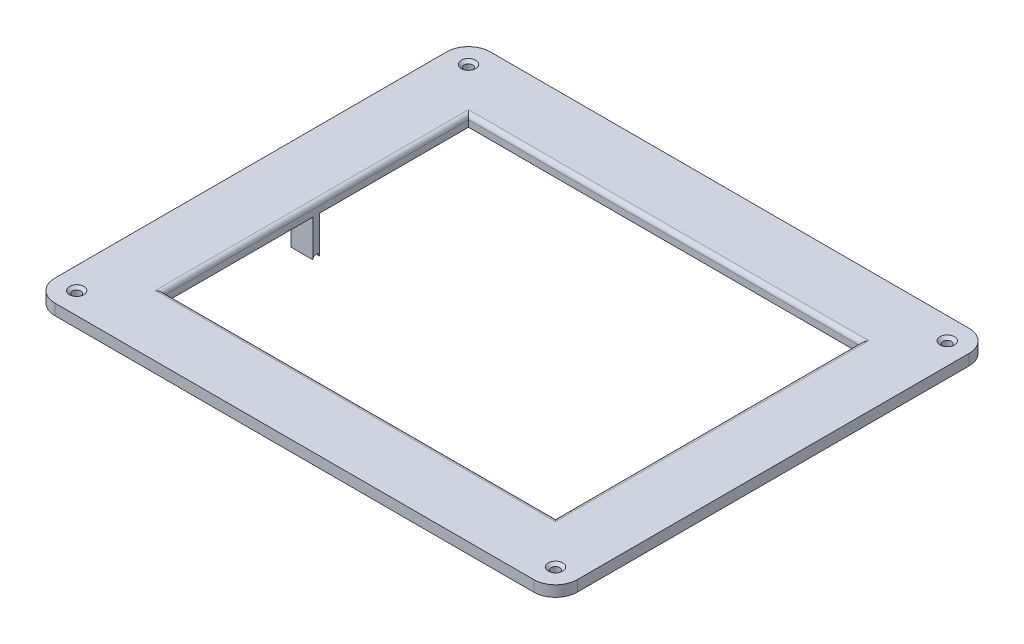
ISO-10303-21;
HEADER;
FILE_DESCRIPTION(('STEP AP214'),'2;1');
FILE_NAME('part.step','',(''),(''),'','','');
FILE_SCHEMA(('AUTOMOTIVE_DESIGN { 1 0 10303 214 1 1 1 1 }'));
ENDSEC;
DATA;
#1=APPLICATION_CONTEXT('core data for automotive mechanical design processes');
#2=APPLICATION_PROTOCOL_DEFINITION('international standard','automotive_design',2000,#1);
#3=PRODUCT_CONTEXT('',#1,'mechanical');
#4=PRODUCT('Part','Part','',(#3));
#5=PRODUCT_RELATED_PRODUCT_CATEGORY('part','',(#4));
#6=PRODUCT_DEFINITION_FORMATION('','',#4);
#7=PRODUCT_DEFINITION_CONTEXT('part definition',#1,'design');
#8=PRODUCT_DEFINITION('design','',#6,#7);
#9=PRODUCT_DEFINITION_SHAPE('','',#8);
#10=(LENGTH_UNIT() NAMED_UNIT(*) SI_UNIT(.MILLI.,.METRE.));
#11=(NAMED_UNIT(*) PLANE_ANGLE_UNIT() SI_UNIT($,.RADIAN.));
#12=(NAMED_UNIT(*) SI_UNIT($,.STERADIAN.) SOLID_ANGLE_UNIT());
#13=UNCERTAINTY_MEASURE_WITH_UNIT(LENGTH_MEASURE(1.E-05),#10,'distance_accuracy_value','');
#14=(GEOMETRIC_REPRESENTATION_CONTEXT(3) GLOBAL_UNCERTAINTY_ASSIGNED_CONTEXT((#13)) GLOBAL_UNIT_ASSIGNED_CONTEXT((#10,
#11,#12)) REPRESENTATION_CONTEXT('',''));
#15=CARTESIAN_POINT('',(0.,0.,0.));
#16=DIRECTION('',(0.,0.,1.));
#17=DIRECTION('',(1.,0.,0.));
#18=AXIS2_PLACEMENT_3D('',#15,#16,#17);
#19=CARTESIAN_POINT('',(152.4,6.35,127.));
#20=DIRECTION('',(-1.,0.,0.));
#21=DIRECTION('',(0.,0.,1.));
#22=AXIS2_PLACEMENT_3D('',#19,#20,#21);
#23=PLANE('',#22);
#24=DIRECTION('',(0.,0.,-1.));
#25=VECTOR('',#24,1.);
#26=CARTESIAN_POINT('',(152.4,0.,127.));
#27=LINE('',#26,#25);
#28=CARTESIAN_POINT('',(152.4,0.,114.3));
#29=VERTEX_POINT('',#28);
#30=CARTESIAN_POINT('',(152.4,0.,-114.3));
#31=VERTEX_POINT('',#30);
#32=EDGE_CURVE('E301',#29,#31,#27,.T.);
#33=ORIENTED_EDGE('',*,*,#32,.T.);
#34=DIRECTION('',(0.,-1.,0.));
#35=VECTOR('',#34,1.);
#36=CARTESIAN_POINT('',(152.4,6.35,-114.3));
#37=LINE('',#36,#35);
#38=CARTESIAN_POINT('',(152.4,6.35,-114.3));
#39=VERTEX_POINT('',#38);
#40=EDGE_CURVE('E406',#31,#39,#37,.F.);
#41=ORIENTED_EDGE('',*,*,#40,.T.);
#42=DIRECTION('',(0.,0.,-1.));
#43=VECTOR('',#42,1.);
#44=CARTESIAN_POINT('',(152.4,6.35,127.));
#45=LINE('',#44,#43);
#46=CARTESIAN_POINT('',(152.4,6.35,114.3));
#47=VERTEX_POINT('',#46);
#48=EDGE_CURVE('E313',#47,#39,#45,.T.);
#49=ORIENTED_EDGE('',*,*,#48,.F.);
#50=DIRECTION('',(0.,-1.,0.));
#51=VECTOR('',#50,1.);
#52=CARTESIAN_POINT('',(152.4,6.35,114.3));
#53=LINE('',#52,#51);
#54=EDGE_CURVE('E402',#47,#29,#53,.T.);
#55=ORIENTED_EDGE('',*,*,#54,.T.);
#56=EDGE_LOOP('',(#33,#41,#49,#55));
#57=FACE_BOUND('',#56,.T.);
#58=ADVANCED_FACE('F42',(#57),#23,.F.);
#59=CARTESIAN_POINT('',(-152.4,6.35,-127.));
#60=DIRECTION('',(0.,0.,1.));
#61=DIRECTION('',(1.,0.,0.));
#62=AXIS2_PLACEMENT_3D('',#59,#60,#61);
#63=PLANE('',#62);
#64=DIRECTION('',(-1.,0.,0.));
#65=VECTOR('',#64,1.);
#66=CARTESIAN_POINT('',(-152.4,6.35,-127.));
#67=LINE('',#66,#65);
#68=CARTESIAN_POINT('',(139.7,6.35,-127.));
#69=VERTEX_POINT('',#68);
#70=CARTESIAN_POINT('',(-139.7,6.35,-127.));
#71=VERTEX_POINT('',#70);
#72=EDGE_CURVE('E317',#69,#71,#67,.T.);
#73=ORIENTED_EDGE('',*,*,#72,.F.);
#74=DIRECTION('',(0.,-1.,0.));
#75=VECTOR('',#74,1.);
#76=CARTESIAN_POINT('',(139.7,6.35,-127.));
#77=LINE('',#76,#75);
#78=CARTESIAN_POINT('',(139.7,0.,-127.));
#79=VERTEX_POINT('',#78);
#80=EDGE_CURVE('E386',#69,#79,#77,.T.);
#81=ORIENTED_EDGE('',*,*,#80,.T.);
#82=DIRECTION('',(-1.,0.,0.));
#83=VECTOR('',#82,1.);
#84=CARTESIAN_POINT('',(-152.4,0.,-127.));
#85=LINE('',#84,#83);
#86=CARTESIAN_POINT('',(-139.7,0.,-127.));
#87=VERTEX_POINT('',#86);
#88=EDGE_CURVE('E334',#79,#87,#85,.T.);
#89=ORIENTED_EDGE('',*,*,#88,.T.);
#90=DIRECTION('',(0.,-1.,0.));
#91=VECTOR('',#90,1.);
#92=CARTESIAN_POINT('',(-139.7,6.35,-127.));
#93=LINE('',#92,#91);
#94=EDGE_CURVE('E370',#87,#71,#93,.F.);
#95=ORIENTED_EDGE('',*,*,#94,.T.);
#96=EDGE_LOOP('',(#73,#81,#89,#95));
#97=FACE_BOUND('',#96,.T.);
#98=ADVANCED_FACE('F598',(#97),#63,.F.);
#99=CARTESIAN_POINT('',(-152.4,6.35,127.));
#100=DIRECTION('',(1.,0.,0.));
#101=DIRECTION('',(0.,0.,-1.));
#102=AXIS2_PLACEMENT_3D('',#99,#100,#101);
#103=PLANE('',#102);
#104=DIRECTION('',(0.,0.,1.));
#105=VECTOR('',#104,1.);
#106=CARTESIAN_POINT('',(-152.4,6.35,127.));
#107=LINE('',#106,#105);
#108=CARTESIAN_POINT('',(-152.4,6.35,-114.3));
#109=VERTEX_POINT('',#108);
#110=CARTESIAN_POINT('',(-152.4,6.35,114.3));
#111=VERTEX_POINT('',#110);
#112=EDGE_CURVE('E322',#109,#111,#107,.T.);
#113=ORIENTED_EDGE('',*,*,#112,.F.);
#114=DIRECTION('',(0.,-1.,0.));
#115=VECTOR('',#114,1.);
#116=CARTESIAN_POINT('',(-152.4,6.35,-114.3));
#117=LINE('',#116,#115);
#118=CARTESIAN_POINT('',(-152.4,0.,-114.3));
#119=VERTEX_POINT('',#118);
#120=EDGE_CURVE('E424',#109,#119,#117,.T.);
#121=ORIENTED_EDGE('',*,*,#120,.T.);
#122=DIRECTION('',(0.,0.,1.));
#123=VECTOR('',#122,1.);
#124=CARTESIAN_POINT('',(-152.4,0.,127.));
#125=LINE('',#124,#123);
#126=CARTESIAN_POINT('',(-152.4,0.,114.3));
#127=VERTEX_POINT('',#126);
#128=EDGE_CURVE('E338',#119,#127,#125,.T.);
#129=ORIENTED_EDGE('',*,*,#128,.T.);
#130=DIRECTION('',(0.,-1.,0.));
#131=VECTOR('',#130,1.);
#132=CARTESIAN_POINT('',(-152.4,6.35,114.3));
#133=LINE('',#132,#131);
#134=EDGE_CURVE('E421',#127,#111,#133,.F.);
#135=ORIENTED_EDGE('',*,*,#134,.T.);
#136=EDGE_LOOP('',(#113,#121,#129,#135));
#137=FACE_BOUND('',#136,.T.);
#138=ADVANCED_FACE('F604',(#137),#103,.F.);
#139=CARTESIAN_POINT('',(-152.4,6.35,127.));
#140=DIRECTION('',(0.,0.,-1.));
#141=DIRECTION('',(-1.,0.,0.));
#142=AXIS2_PLACEMENT_3D('',#139,#140,#141);
#143=PLANE('',#142);
#144=DIRECTION('',(1.,0.,0.));
#145=VECTOR('',#144,1.);
#146=CARTESIAN_POINT('',(-152.4,6.35,127.));
#147=LINE('',#146,#145);
#148=CARTESIAN_POINT('',(-139.7,6.35,127.));
#149=VERTEX_POINT('',#148);
#150=CARTESIAN_POINT('',(139.7,6.35,127.));
#151=VERTEX_POINT('',#150);
#152=EDGE_CURVE('E326',#149,#151,#147,.T.);
#153=ORIENTED_EDGE('',*,*,#152,.F.);
#154=DIRECTION('',(0.,-1.,0.));
#155=VECTOR('',#154,1.);
#156=CARTESIAN_POINT('',(-139.7,6.35,127.));
#157=LINE('',#156,#155);
#158=CARTESIAN_POINT('',(-139.7,0.,127.));
#159=VERTEX_POINT('',#158);
#160=EDGE_CURVE('E11',#149,#159,#157,.T.);
#161=ORIENTED_EDGE('',*,*,#160,.T.);
#162=DIRECTION('',(1.,0.,0.));
#163=VECTOR('',#162,1.);
#164=CARTESIAN_POINT('',(-152.4,0.,127.));
#165=LINE('',#164,#163);
#166=CARTESIAN_POINT('',(139.7,0.,127.));
#167=VERTEX_POINT('',#166);
#168=EDGE_CURVE('E318',#159,#167,#165,.T.);
#169=ORIENTED_EDGE('',*,*,#168,.T.);
#170=DIRECTION('',(0.,-1.,0.));
#171=VECTOR('',#170,1.);
#172=CARTESIAN_POINT('',(139.7,6.35,127.));
#173=LINE('',#172,#171);
#174=EDGE_CURVE('E52',#167,#151,#173,.F.);
#175=ORIENTED_EDGE('',*,*,#174,.T.);
#176=EDGE_LOOP('',(#153,#161,#169,#175));
#177=FACE_BOUND('',#176,.T.);
#178=ADVANCED_FACE('F642',(#177),#143,.F.);
#179=CARTESIAN_POINT('',(0.,6.35,0.));
#180=DIRECTION('',(0.,-1.,0.));
#181=DIRECTION('',(0.,0.,-1.));
#182=AXIS2_PLACEMENT_3D('',#179,#180,#181);
#183=PLANE('',#182);
#184=CARTESIAN_POINT('',(-139.7,6.35,114.3));
#185=DIRECTION('',(0.,1.,0.));
#186=DIRECTION('',(0.,0.,1.));
#187=AXIS2_PLACEMENT_3D('',#184,#185,#186);
#188=CIRCLE('',#187,4.21640000000001);
#189=CARTESIAN_POINT('',(-139.7,6.35,118.5164));
#190=VERTEX_POINT('',#189);
#191=EDGE_CURVE('E996',#190,#190,#188,.T.);
#192=ORIENTED_EDGE('',*,*,#191,.F.);
#193=EDGE_LOOP('',(#192));
#194=FACE_BOUND('',#193,.T.);
#195=CARTESIAN_POINT('',(139.7,6.35,114.3));
#196=DIRECTION('',(0.,1.,0.));
#197=DIRECTION('',(0.,0.,1.));
#198=AXIS2_PLACEMENT_3D('',#195,#196,#197);
#199=CIRCLE('',#198,4.21640000000001);
#200=CARTESIAN_POINT('',(139.7,6.35,118.5164));
#201=VERTEX_POINT('',#200);
#202=EDGE_CURVE('E452',#201,#201,#199,.T.);
#203=ORIENTED_EDGE('',*,*,#202,.F.);
#204=EDGE_LOOP('',(#203));
#205=FACE_BOUND('',#204,.T.);
#206=CARTESIAN_POINT('',(139.7,6.35,-114.3));
#207=DIRECTION('',(0.,1.,0.));
#208=DIRECTION('',(0.,0.,1.));
#209=AXIS2_PLACEMENT_3D('',#206,#207,#208);
#210=CIRCLE('',#209,4.21640000000001);
#211=CARTESIAN_POINT('',(139.7,6.35,-110.0836));
#212=VERTEX_POINT('',#211);
#213=EDGE_CURVE('E442',#212,#212,#210,.T.);
#214=ORIENTED_EDGE('',*,*,#213,.F.);
#215=EDGE_LOOP('',(#214));
#216=FACE_BOUND('',#215,.T.);
#217=CARTESIAN_POINT('',(-139.7,6.35,-114.3));
#218=DIRECTION('',(0.,1.,0.));
#219=DIRECTION('',(0.,0.,1.));
#220=AXIS2_PLACEMENT_3D('',#217,#218,#219);
#221=CIRCLE('',#220,4.21640000000001);
#222=CARTESIAN_POINT('',(-139.7,6.35,-110.0836));
#223=VERTEX_POINT('',#222);
#224=EDGE_CURVE('E437',#223,#223,#221,.T.);
#225=ORIENTED_EDGE('',*,*,#224,.F.);
#226=EDGE_LOOP('',(#225));
#227=FACE_BOUND('',#226,.T.);
#228=DIRECTION('',(0.,0.,-1.));
#229=VECTOR('',#228,1.);
#230=CARTESIAN_POINT('',(116.84,6.35,0.));
#231=LINE('',#230,#229);
#232=CARTESIAN_POINT('',(116.84,6.35,-91.44));
#233=VERTEX_POINT('',#232);
#234=CARTESIAN_POINT('',(116.84,6.35,91.44));
#235=VERTEX_POINT('',#234);
#236=EDGE_CURVE('E354',#233,#235,#231,.F.);
#237=ORIENTED_EDGE('',*,*,#236,.T.);
#238=DIRECTION('',(1.,0.,0.));
#239=VECTOR('',#238,1.);
#240=CARTESIAN_POINT('',(0.,6.35,91.44));
#241=LINE('',#240,#239);
#242=CARTESIAN_POINT('',(-116.84,6.35,91.44));
#243=VERTEX_POINT('',#242);
#244=EDGE_CURVE('E357',#235,#243,#241,.F.);
#245=ORIENTED_EDGE('',*,*,#244,.T.);
#246=DIRECTION('',(0.,0.,1.));
#247=VECTOR('',#246,1.);
#248=CARTESIAN_POINT('',(-116.84,6.35,0.));
#249=LINE('',#248,#247);
#250=CARTESIAN_POINT('',(-116.84,6.35,-91.44));
#251=VERTEX_POINT('',#250);
#252=EDGE_CURVE('E351',#243,#251,#249,.F.);
#253=ORIENTED_EDGE('',*,*,#252,.T.);
#254=DIRECTION('',(-1.,0.,0.));
#255=VECTOR('',#254,1.);
#256=CARTESIAN_POINT('',(0.,6.35,-91.44));
#257=LINE('',#256,#255);
#258=EDGE_CURVE('E348',#251,#233,#257,.F.);
#259=ORIENTED_EDGE('',*,*,#258,.T.);
#260=EDGE_LOOP('',(#237,#245,#253,#259));
#261=FACE_BOUND('',#260,.T.);
#262=ORIENTED_EDGE('',*,*,#48,.T.);
#263=CARTESIAN_POINT('',(139.7,6.35,-114.3));
#264=DIRECTION('',(0.,-1.,0.));
#265=DIRECTION('',(0.,0.,-1.));
#266=AXIS2_PLACEMENT_3D('',#263,#264,#265);
#267=CIRCLE('',#266,12.7);
#268=EDGE_CURVE('E418',#39,#69,#267,.F.);
#269=ORIENTED_EDGE('',*,*,#268,.T.);
#270=ORIENTED_EDGE('',*,*,#72,.T.);
#271=CARTESIAN_POINT('',(-139.7,6.35,-114.3));
#272=DIRECTION('',(0.,-1.,0.));
#273=DIRECTION('',(0.,0.,-1.));
#274=AXIS2_PLACEMENT_3D('',#271,#272,#273);
#275=CIRCLE('',#274,12.7);
#276=EDGE_CURVE('E415',#71,#109,#275,.F.);
#277=ORIENTED_EDGE('',*,*,#276,.T.);
#278=ORIENTED_EDGE('',*,*,#112,.T.);
#279=CARTESIAN_POINT('',(-139.7,6.35,114.3));
#280=DIRECTION('',(0.,-1.,0.));
#281=DIRECTION('',(0.,0.,-1.));
#282=AXIS2_PLACEMENT_3D('',#279,#280,#281);
#283=CIRCLE('',#282,12.7);
#284=EDGE_CURVE('E412',#111,#149,#283,.F.);
#285=ORIENTED_EDGE('',*,*,#284,.T.);
#286=ORIENTED_EDGE('',*,*,#152,.T.);
#287=CARTESIAN_POINT('',(139.7,6.35,114.3));
#288=DIRECTION('',(0.,-1.,0.));
#289=DIRECTION('',(0.,0.,-1.));
#290=AXIS2_PLACEMENT_3D('',#287,#288,#289);
#291=CIRCLE('',#290,12.7);
#292=EDGE_CURVE('E409',#151,#47,#291,.F.);
#293=ORIENTED_EDGE('',*,*,#292,.T.);
#294=EDGE_LOOP('',(#262,#269,#270,#277,#278,#285,#286,#293));
#295=FACE_BOUND('',#294,.T.);
#296=ADVANCED_FACE('F638',(#194,#205,#216,#227,#261,#295),#183,.F.);
#297=CARTESIAN_POINT('',(0.,0.,0.));
#298=DIRECTION('',(0.,-1.,0.));
#299=DIRECTION('',(0.,0.,-1.));
#300=AXIS2_PLACEMENT_3D('',#297,#298,#299);
#301=PLANE('',#300);
#302=CARTESIAN_POINT('',(-139.7,0.,114.3));
#303=DIRECTION('',(0.,-1.,0.));
#304=DIRECTION('',(0.,0.,-1.));
#305=AXIS2_PLACEMENT_3D('',#302,#303,#304);
#306=CIRCLE('',#305,2.45745);
#307=CARTESIAN_POINT('',(-139.7,0.,111.84255));
#308=VERTEX_POINT('',#307);
#309=EDGE_CURVE('E46',#308,#308,#306,.T.);
#310=ORIENTED_EDGE('',*,*,#309,.F.);
#311=EDGE_LOOP('',(#310));
#312=FACE_BOUND('',#311,.T.);
#313=CARTESIAN_POINT('',(139.7,0.,114.3));
#314=DIRECTION('',(0.,-1.,0.));
#315=DIRECTION('',(0.,0.,-1.));
#316=AXIS2_PLACEMENT_3D('',#313,#314,#315);
#317=CIRCLE('',#316,2.45745);
#318=CARTESIAN_POINT('',(139.7,0.,111.84255));
#319=VERTEX_POINT('',#318);
#320=EDGE_CURVE('E439',#319,#319,#317,.T.);
#321=ORIENTED_EDGE('',*,*,#320,.F.);
#322=EDGE_LOOP('',(#321));
#323=FACE_BOUND('',#322,.T.);
#324=CARTESIAN_POINT('',(139.7,0.,-114.3));
#325=DIRECTION('',(0.,-1.,0.));
#326=DIRECTION('',(0.,0.,-1.));
#327=AXIS2_PLACEMENT_3D('',#324,#325,#326);
#328=CIRCLE('',#327,2.45745);
#329=CARTESIAN_POINT('',(139.7,0.,-116.75745));
#330=VERTEX_POINT('',#329);
#331=EDGE_CURVE('E434',#330,#330,#328,.T.);
#332=ORIENTED_EDGE('',*,*,#331,.F.);
#333=EDGE_LOOP('',(#332));
#334=FACE_BOUND('',#333,.T.);
#335=CARTESIAN_POINT('',(-139.7,0.,-114.3));
#336=DIRECTION('',(0.,-1.,0.));
#337=DIRECTION('',(0.,0.,-1.));
#338=AXIS2_PLACEMENT_3D('',#335,#336,#337);
#339=CIRCLE('',#338,2.45745);
#340=CARTESIAN_POINT('',(-139.7,0.,-116.75745));
#341=VERTEX_POINT('',#340);
#342=EDGE_CURVE('E205',#341,#341,#339,.T.);
#343=ORIENTED_EDGE('',*,*,#342,.F.);
#344=EDGE_LOOP('',(#343));
#345=FACE_BOUND('',#344,.T.);
#346=DIRECTION('',(-1.,0.,0.));
#347=VECTOR('',#346,1.);
#348=CARTESIAN_POINT('',(114.3,0.,-1.90500000000001));
#349=LINE('',#348,#347);
#350=CARTESIAN_POINT('',(127.,0.,-1.90500000000002));
#351=VERTEX_POINT('',#350);
#352=CARTESIAN_POINT('',(114.3,0.,-1.90500000000001));
#353=VERTEX_POINT('',#352);
#354=EDGE_CURVE('E225',#351,#353,#349,.T.);
#355=ORIENTED_EDGE('',*,*,#354,.T.);
#356=DIRECTION('',(0.,0.,-1.));
#357=VECTOR('',#356,1.);
#358=CARTESIAN_POINT('',(114.3,0.,88.9));
#359=LINE('',#358,#357);
#360=CARTESIAN_POINT('',(114.3,0.,-88.9));
#361=VERTEX_POINT('',#360);
#362=EDGE_CURVE('E284',#353,#361,#359,.T.);
#363=ORIENTED_EDGE('',*,*,#362,.T.);
#364=DIRECTION('',(-1.,0.,0.));
#365=VECTOR('',#364,1.);
#366=CARTESIAN_POINT('',(-114.3,0.,-88.9));
#367=LINE('',#366,#365);
#368=CARTESIAN_POINT('',(-114.3,0.,-88.9));
#369=VERTEX_POINT('',#368);
#370=EDGE_CURVE('E283',#361,#369,#367,.T.);
#371=ORIENTED_EDGE('',*,*,#370,.T.);
#372=DIRECTION('',(0.,0.,1.));
#373=VECTOR('',#372,1.);
#374=CARTESIAN_POINT('',(-114.3,0.,88.9));
#375=LINE('',#374,#373);
#376=CARTESIAN_POINT('',(-114.3,0.,-1.90500000000002));
#377=VERTEX_POINT('',#376);
#378=EDGE_CURVE('E289',#369,#377,#375,.T.);
#379=ORIENTED_EDGE('',*,*,#378,.T.);
#380=DIRECTION('',(1.,0.,0.));
#381=VECTOR('',#380,1.);
#382=CARTESIAN_POINT('',(-114.3,0.,-1.90500000000001));
#383=LINE('',#382,#381);
#384=CARTESIAN_POINT('',(-127.,0.,-1.90500000000002));
#385=VERTEX_POINT('',#384);
#386=EDGE_CURVE('E250',#385,#377,#383,.T.);
#387=ORIENTED_EDGE('',*,*,#386,.F.);
#388=DIRECTION('',(0.,0.,-1.));
#389=VECTOR('',#388,1.);
#390=CARTESIAN_POINT('',(-127.,0.,1.90499999999998));
#391=LINE('',#390,#389);
#392=CARTESIAN_POINT('',(-127.,0.,1.90499999999998));
#393=VERTEX_POINT('',#392);
#394=EDGE_CURVE('E257',#393,#385,#391,.T.);
#395=ORIENTED_EDGE('',*,*,#394,.F.);
#396=DIRECTION('',(-1.,0.,0.));
#397=VECTOR('',#396,1.);
#398=CARTESIAN_POINT('',(-114.3,0.,1.90499999999999));
#399=LINE('',#398,#397);
#400=CARTESIAN_POINT('',(-114.3,0.,1.90499999999999));
#401=VERTEX_POINT('',#400);
#402=EDGE_CURVE('E243',#401,#393,#399,.T.);
#403=ORIENTED_EDGE('',*,*,#402,.F.);
#404=CARTESIAN_POINT('',(-114.3,0.,88.9));
#405=VERTEX_POINT('',#404);
#406=EDGE_CURVE('E288',#401,#405,#375,.T.);
#407=ORIENTED_EDGE('',*,*,#406,.T.);
#408=DIRECTION('',(1.,0.,0.));
#409=VECTOR('',#408,1.);
#410=CARTESIAN_POINT('',(-114.3,0.,88.9));
#411=LINE('',#410,#409);
#412=CARTESIAN_POINT('',(114.3,0.,88.9));
#413=VERTEX_POINT('',#412);
#414=EDGE_CURVE('E292',#405,#413,#411,.T.);
#415=ORIENTED_EDGE('',*,*,#414,.T.);
#416=CARTESIAN_POINT('',(114.3,0.,1.90499999999999));
#417=VERTEX_POINT('',#416);
#418=EDGE_CURVE('E280',#413,#417,#359,.T.);
#419=ORIENTED_EDGE('',*,*,#418,.T.);
#420=DIRECTION('',(1.,0.,0.));
#421=VECTOR('',#420,1.);
#422=CARTESIAN_POINT('',(114.3,0.,1.90499999999999));
#423=LINE('',#422,#421);
#424=CARTESIAN_POINT('',(127.,0.,1.90499999999998));
#425=VERTEX_POINT('',#424);
#426=EDGE_CURVE('E65',#417,#425,#423,.T.);
#427=ORIENTED_EDGE('',*,*,#426,.T.);
#428=DIRECTION('',(0.,0.,-1.));
#429=VECTOR('',#428,1.);
#430=CARTESIAN_POINT('',(127.,0.,1.90499999999998));
#431=LINE('',#430,#429);
#432=EDGE_CURVE('E60',#425,#351,#431,.T.);
#433=ORIENTED_EDGE('',*,*,#432,.T.);
#434=EDGE_LOOP('',(#355,#363,#371,#379,#387,#395,#403,#407,#415,#419,#427,#433));
#435=FACE_BOUND('',#434,.T.);
#436=ORIENTED_EDGE('',*,*,#88,.F.);
#437=CARTESIAN_POINT('',(139.7,0.,-114.3));
#438=DIRECTION('',(0.,-1.,0.));
#439=DIRECTION('',(0.,0.,-1.));
#440=AXIS2_PLACEMENT_3D('',#437,#438,#439);
#441=CIRCLE('',#440,12.7);
#442=EDGE_CURVE('E399',#79,#31,#441,.T.);
#443=ORIENTED_EDGE('',*,*,#442,.T.);
#444=ORIENTED_EDGE('',*,*,#32,.F.);
#445=CARTESIAN_POINT('',(139.7,0.,114.3));
#446=DIRECTION('',(0.,-1.,0.));
#447=DIRECTION('',(0.,0.,-1.));
#448=AXIS2_PLACEMENT_3D('',#445,#446,#447);
#449=CIRCLE('',#448,12.7);
#450=EDGE_CURVE('E390',#29,#167,#449,.T.);
#451=ORIENTED_EDGE('',*,*,#450,.T.);
#452=ORIENTED_EDGE('',*,*,#168,.F.);
#453=CARTESIAN_POINT('',(-139.7,0.,114.3));
#454=DIRECTION('',(0.,-1.,0.));
#455=DIRECTION('',(0.,0.,-1.));
#456=AXIS2_PLACEMENT_3D('',#453,#454,#455);
#457=CIRCLE('',#456,12.7);
#458=EDGE_CURVE('E393',#159,#127,#457,.T.);
#459=ORIENTED_EDGE('',*,*,#458,.T.);
#460=ORIENTED_EDGE('',*,*,#128,.F.);
#461=CARTESIAN_POINT('',(-139.7,0.,-114.3));
#462=DIRECTION('',(0.,-1.,0.));
#463=DIRECTION('',(0.,0.,-1.));
#464=AXIS2_PLACEMENT_3D('',#461,#462,#463);
#465=CIRCLE('',#464,12.7);
#466=EDGE_CURVE('E396',#119,#87,#465,.T.);
#467=ORIENTED_EDGE('',*,*,#466,.T.);
#468=EDGE_LOOP('',(#436,#443,#444,#451,#452,#459,#460,#467));
#469=FACE_BOUND('',#468,.T.);
#470=ADVANCED_FACE('F480',(#312,#323,#334,#345,#435,#469),#301,.T.);
#471=CARTESIAN_POINT('',(114.3,0.,88.9));
#472=DIRECTION('',(1.,0.,0.));
#473=DIRECTION('',(0.,0.,-1.));
#474=AXIS2_PLACEMENT_3D('',#471,#472,#473);
#475=PLANE('',#474);
#476=CARTESIAN_POINT('',(114.3,-21.59,0.));
#477=DIRECTION('',(-1.,0.,0.));
#478=DIRECTION('',(0.,0.,1.));
#479=AXIS2_PLACEMENT_3D('',#476,#477,#478);
#480=CIRCLE('',#479,1.905);
#481=CARTESIAN_POINT('',(114.3,-21.59,1.905));
#482=VERTEX_POINT('',#481);
#483=CARTESIAN_POINT('',(114.3,-21.59,-1.90500000000001));
#484=VERTEX_POINT('',#483);
#485=EDGE_CURVE('E204',#482,#484,#480,.T.);
#486=ORIENTED_EDGE('',*,*,#485,.F.);
#487=DIRECTION('',(0.,1.,0.));
#488=VECTOR('',#487,1.);
#489=CARTESIAN_POINT('',(114.3,-21.59,1.90499999999999));
#490=LINE('',#489,#488);
#491=EDGE_CURVE('E212',#482,#417,#490,.T.);
#492=ORIENTED_EDGE('',*,*,#491,.T.);
#493=ORIENTED_EDGE('',*,*,#418,.F.);
#494=DIRECTION('',(0.,1.,0.));
#495=VECTOR('',#494,1.);
#496=CARTESIAN_POINT('',(114.3,0.,88.9));
#497=LINE('',#496,#495);
#498=CARTESIAN_POINT('',(114.3,3.81,88.9));
#499=VERTEX_POINT('',#498);
#500=EDGE_CURVE('E297',#413,#499,#497,.T.);
#501=ORIENTED_EDGE('',*,*,#500,.T.);
#502=DIRECTION('',(0.,0.,-1.));
#503=VECTOR('',#502,1.);
#504=CARTESIAN_POINT('',(114.3,3.81,88.9));
#505=LINE('',#504,#503);
#506=CARTESIAN_POINT('',(114.3,3.81,-88.9));
#507=VERTEX_POINT('',#506);
#508=EDGE_CURVE('E361',#499,#507,#505,.T.);
#509=ORIENTED_EDGE('',*,*,#508,.T.);
#510=DIRECTION('',(0.,1.,0.));
#511=VECTOR('',#510,1.);
#512=CARTESIAN_POINT('',(114.3,0.,-88.9));
#513=LINE('',#512,#511);
#514=EDGE_CURVE('E296',#361,#507,#513,.T.);
#515=ORIENTED_EDGE('',*,*,#514,.F.);
#516=ORIENTED_EDGE('',*,*,#362,.F.);
#517=DIRECTION('',(0.,1.,0.));
#518=VECTOR('',#517,1.);
#519=CARTESIAN_POINT('',(114.3,-21.59,-1.90500000000001));
#520=LINE('',#519,#518);
#521=EDGE_CURVE('E234',#484,#353,#520,.T.);
#522=ORIENTED_EDGE('',*,*,#521,.F.);
#523=EDGE_LOOP('',(#486,#492,#493,#501,#509,#515,#516,#522));
#524=FACE_BOUND('',#523,.T.);
#525=ADVANCED_FACE('F475',(#524),#475,.F.);
#526=CARTESIAN_POINT('',(-114.3,0.,88.9));
#527=DIRECTION('',(0.,0.,1.));
#528=DIRECTION('',(1.,0.,0.));
#529=AXIS2_PLACEMENT_3D('',#526,#527,#528);
#530=PLANE('',#529);
#531=DIRECTION('',(0.,1.,0.));
#532=VECTOR('',#531,1.);
#533=CARTESIAN_POINT('',(-114.3,0.,88.9));
#534=LINE('',#533,#532);
#535=CARTESIAN_POINT('',(-114.3,3.81,88.9));
#536=VERTEX_POINT('',#535);
#537=EDGE_CURVE('E302',#405,#536,#534,.T.);
#538=ORIENTED_EDGE('',*,*,#537,.T.);
#539=DIRECTION('',(1.,0.,0.));
#540=VECTOR('',#539,1.);
#541=CARTESIAN_POINT('',(-114.3,3.81,88.9));
#542=LINE('',#541,#540);
#543=EDGE_CURVE('E330',#536,#499,#542,.T.);
#544=ORIENTED_EDGE('',*,*,#543,.T.);
#545=ORIENTED_EDGE('',*,*,#500,.F.);
#546=ORIENTED_EDGE('',*,*,#414,.F.);
#547=EDGE_LOOP('',(#538,#544,#545,#546));
#548=FACE_BOUND('',#547,.T.);
#549=ADVANCED_FACE('F509',(#548),#530,.F.);
#550=CARTESIAN_POINT('',(-114.3,0.,88.9));
#551=DIRECTION('',(-1.,0.,0.));
#552=DIRECTION('',(0.,0.,1.));
#553=AXIS2_PLACEMENT_3D('',#550,#551,#552);
#554=PLANE('',#553);
#555=DIRECTION('',(0.,1.,0.));
#556=VECTOR('',#555,1.);
#557=CARTESIAN_POINT('',(-114.3,-21.59,1.90499999999999));
#558=LINE('',#557,#556);
#559=CARTESIAN_POINT('',(-114.3,-21.59,1.90499999999999));
#560=VERTEX_POINT('',#559);
#561=EDGE_CURVE('E275',#560,#401,#558,.T.);
#562=ORIENTED_EDGE('',*,*,#561,.F.);
#563=CARTESIAN_POINT('',(-114.3,-21.59,0.));
#564=DIRECTION('',(-1.,0.,0.));
#565=DIRECTION('',(0.,0.,1.));
#566=AXIS2_PLACEMENT_3D('',#563,#564,#565);
#567=CIRCLE('',#566,1.905);
#568=CARTESIAN_POINT('',(-114.3,-21.59,-1.905));
#569=VERTEX_POINT('',#568);
#570=EDGE_CURVE('E239',#560,#569,#567,.T.);
#571=ORIENTED_EDGE('',*,*,#570,.T.);
#572=DIRECTION('',(0.,1.,0.));
#573=VECTOR('',#572,1.);
#574=CARTESIAN_POINT('',(-114.3,-21.59,-1.90500000000001));
#575=LINE('',#574,#573);
#576=EDGE_CURVE('E253',#569,#377,#575,.T.);
#577=ORIENTED_EDGE('',*,*,#576,.T.);
#578=ORIENTED_EDGE('',*,*,#378,.F.);
#579=DIRECTION('',(0.,1.,0.));
#580=VECTOR('',#579,1.);
#581=CARTESIAN_POINT('',(-114.3,0.,-88.9));
#582=LINE('',#581,#580);
#583=CARTESIAN_POINT('',(-114.3,3.81,-88.9));
#584=VERTEX_POINT('',#583);
#585=EDGE_CURVE('E306',#369,#584,#582,.T.);
#586=ORIENTED_EDGE('',*,*,#585,.T.);
#587=DIRECTION('',(0.,0.,1.));
#588=VECTOR('',#587,1.);
#589=CARTESIAN_POINT('',(-114.3,3.81,88.9));
#590=LINE('',#589,#588);
#591=EDGE_CURVE('E364',#584,#536,#590,.T.);
#592=ORIENTED_EDGE('',*,*,#591,.T.);
#593=ORIENTED_EDGE('',*,*,#537,.F.);
#594=ORIENTED_EDGE('',*,*,#406,.F.);
#595=EDGE_LOOP('',(#562,#571,#577,#578,#586,#592,#593,#594));
#596=FACE_BOUND('',#595,.T.);
#597=ADVANCED_FACE('F492',(#596),#554,.F.);
#598=CARTESIAN_POINT('',(-114.3,0.,-88.9));
#599=DIRECTION('',(0.,0.,-1.));
#600=DIRECTION('',(-1.,0.,0.));
#601=AXIS2_PLACEMENT_3D('',#598,#599,#600);
#602=PLANE('',#601);
#603=ORIENTED_EDGE('',*,*,#514,.T.);
#604=DIRECTION('',(-1.,0.,0.));
#605=VECTOR('',#604,1.);
#606=CARTESIAN_POINT('',(-114.3,3.81,-88.9));
#607=LINE('',#606,#605);
#608=EDGE_CURVE('E367',#507,#584,#607,.T.);
#609=ORIENTED_EDGE('',*,*,#608,.T.);
#610=ORIENTED_EDGE('',*,*,#585,.F.);
#611=ORIENTED_EDGE('',*,*,#370,.F.);
#612=EDGE_LOOP('',(#603,#609,#610,#611));
#613=FACE_BOUND('',#612,.T.);
#614=ADVANCED_FACE('F488',(#613),#602,.F.);
#615=CARTESIAN_POINT('',(-114.3,3.81,-91.44));
#616=DIRECTION('',(-1.,0.,0.));
#617=DIRECTION('',(0.,0.,1.));
#618=AXIS2_PLACEMENT_3D('',#615,#616,#617);
#619=CYLINDRICAL_SURFACE('',#618,2.54);
#620=CARTESIAN_POINT('',(116.84,3.81,-91.44));
#621=DIRECTION('',(-0.707106781186547,0.,-0.707106781186547));
#622=DIRECTION('',(0.707106781186547,0.,-0.707106781186547));
#623=AXIS2_PLACEMENT_3D('',#620,#621,#622);
#624=ELLIPSE('',#623,3.59210244842766,2.54);
#625=EDGE_CURVE('E376',#233,#507,#624,.F.);
#626=ORIENTED_EDGE('',*,*,#625,.F.);
#627=ORIENTED_EDGE('',*,*,#258,.F.);
#628=CARTESIAN_POINT('',(-116.84,3.81,-91.44));
#629=DIRECTION('',(-0.707106781186547,0.,0.707106781186547));
#630=DIRECTION('',(0.707106781186547,0.,0.707106781186547));
#631=AXIS2_PLACEMENT_3D('',#628,#629,#630);
#632=ELLIPSE('',#631,3.59210244842766,2.54);
#633=EDGE_CURVE('E380',#584,#251,#632,.T.);
#634=ORIENTED_EDGE('',*,*,#633,.F.);
#635=ORIENTED_EDGE('',*,*,#608,.F.);
#636=EDGE_LOOP('',(#626,#627,#634,#635));
#637=FACE_BOUND('',#636,.T.);
#638=ADVANCED_FACE('F498',(#637),#619,.T.);
#639=CARTESIAN_POINT('',(-116.84,3.81,88.9));
#640=DIRECTION('',(0.,0.,1.));
#641=DIRECTION('',(1.,0.,0.));
#642=AXIS2_PLACEMENT_3D('',#639,#640,#641);
#643=CYLINDRICAL_SURFACE('',#642,2.54);
#644=ORIENTED_EDGE('',*,*,#633,.T.);
#645=ORIENTED_EDGE('',*,*,#252,.F.);
#646=CARTESIAN_POINT('',(-116.84,3.81,91.44));
#647=DIRECTION('',(0.707106781186547,0.,0.707106781186547));
#648=DIRECTION('',(0.707106781186547,0.,-0.707106781186547));
#649=AXIS2_PLACEMENT_3D('',#646,#647,#648);
#650=ELLIPSE('',#649,3.59210244842766,2.54);
#651=EDGE_CURVE('E373',#536,#243,#650,.T.);
#652=ORIENTED_EDGE('',*,*,#651,.F.);
#653=ORIENTED_EDGE('',*,*,#591,.F.);
#654=EDGE_LOOP('',(#644,#645,#652,#653));
#655=FACE_BOUND('',#654,.T.);
#656=ADVANCED_FACE('F502',(#655),#643,.T.);
#657=CARTESIAN_POINT('',(116.84,3.81,88.9));
#658=DIRECTION('',(0.,0.,-1.));
#659=DIRECTION('',(-1.,0.,0.));
#660=AXIS2_PLACEMENT_3D('',#657,#658,#659);
#661=CYLINDRICAL_SURFACE('',#660,2.54);
#662=ORIENTED_EDGE('',*,*,#625,.T.);
#663=ORIENTED_EDGE('',*,*,#508,.F.);
#664=CARTESIAN_POINT('',(116.84,3.81,91.44));
#665=DIRECTION('',(0.707106781186547,0.,-0.707106781186547));
#666=DIRECTION('',(0.707106781186547,0.,0.707106781186547));
#667=AXIS2_PLACEMENT_3D('',#664,#665,#666);
#668=ELLIPSE('',#667,3.59210244842766,2.54);
#669=EDGE_CURVE('E279',#235,#499,#668,.F.);
#670=ORIENTED_EDGE('',*,*,#669,.F.);
#671=ORIENTED_EDGE('',*,*,#236,.F.);
#672=EDGE_LOOP('',(#662,#663,#670,#671));
#673=FACE_BOUND('',#672,.T.);
#674=ADVANCED_FACE('F612',(#673),#661,.T.);
#675=CARTESIAN_POINT('',(-114.3,3.81,91.44));
#676=DIRECTION('',(1.,0.,0.));
#677=DIRECTION('',(0.,0.,-1.));
#678=AXIS2_PLACEMENT_3D('',#675,#676,#677);
#679=CYLINDRICAL_SURFACE('',#678,2.54);
#680=ORIENTED_EDGE('',*,*,#651,.T.);
#681=ORIENTED_EDGE('',*,*,#244,.F.);
#682=ORIENTED_EDGE('',*,*,#669,.T.);
#683=ORIENTED_EDGE('',*,*,#543,.F.);
#684=EDGE_LOOP('',(#680,#681,#682,#683));
#685=FACE_BOUND('',#684,.T.);
#686=ADVANCED_FACE('F506',(#685),#679,.T.);
#687=CARTESIAN_POINT('',(139.7,6.35,-114.3));
#688=DIRECTION('',(0.,-1.,0.));
#689=DIRECTION('',(0.,0.,-1.));
#690=AXIS2_PLACEMENT_3D('',#687,#688,#689);
#691=CYLINDRICAL_SURFACE('',#690,12.7);
#692=ORIENTED_EDGE('',*,*,#268,.F.);
#693=ORIENTED_EDGE('',*,*,#40,.F.);
#694=ORIENTED_EDGE('',*,*,#442,.F.);
#695=ORIENTED_EDGE('',*,*,#80,.F.);
#696=EDGE_LOOP('',(#692,#693,#694,#695));
#697=FACE_BOUND('',#696,.T.);
#698=ADVANCED_FACE('F611',(#697),#691,.T.);
#699=CARTESIAN_POINT('',(-139.7,6.35,-114.3));
#700=DIRECTION('',(0.,-1.,0.));
#701=DIRECTION('',(0.,0.,-1.));
#702=AXIS2_PLACEMENT_3D('',#699,#700,#701);
#703=CYLINDRICAL_SURFACE('',#702,12.7);
#704=ORIENTED_EDGE('',*,*,#276,.F.);
#705=ORIENTED_EDGE('',*,*,#94,.F.);
#706=ORIENTED_EDGE('',*,*,#466,.F.);
#707=ORIENTED_EDGE('',*,*,#120,.F.);
#708=EDGE_LOOP('',(#704,#705,#706,#707));
#709=FACE_BOUND('',#708,.T.);
#710=ADVANCED_FACE('F622',(#709),#703,.T.);
#711=CARTESIAN_POINT('',(-139.7,6.35,114.3));
#712=DIRECTION('',(0.,-1.,0.));
#713=DIRECTION('',(0.,0.,-1.));
#714=AXIS2_PLACEMENT_3D('',#711,#712,#713);
#715=CYLINDRICAL_SURFACE('',#714,12.7);
#716=ORIENTED_EDGE('',*,*,#284,.F.);
#717=ORIENTED_EDGE('',*,*,#134,.F.);
#718=ORIENTED_EDGE('',*,*,#458,.F.);
#719=ORIENTED_EDGE('',*,*,#160,.F.);
#720=EDGE_LOOP('',(#716,#717,#718,#719));
#721=FACE_BOUND('',#720,.T.);
#722=ADVANCED_FACE('F625',(#721),#715,.T.);
#723=CARTESIAN_POINT('',(139.7,6.35,114.3));
#724=DIRECTION('',(0.,-1.,0.));
#725=DIRECTION('',(0.,0.,-1.));
#726=AXIS2_PLACEMENT_3D('',#723,#724,#725);
#727=CYLINDRICAL_SURFACE('',#726,12.7);
#728=ORIENTED_EDGE('',*,*,#292,.F.);
#729=ORIENTED_EDGE('',*,*,#174,.F.);
#730=ORIENTED_EDGE('',*,*,#450,.F.);
#731=ORIENTED_EDGE('',*,*,#54,.F.);
#732=EDGE_LOOP('',(#728,#729,#730,#731));
#733=FACE_BOUND('',#732,.T.);
#734=ADVANCED_FACE('F44',(#733),#727,.T.);
#735=CARTESIAN_POINT('',(-114.3,-21.59,1.90499999999999));
#736=DIRECTION('',(0.,0.,-1.));
#737=DIRECTION('',(-1.,0.,0.));
#738=AXIS2_PLACEMENT_3D('',#735,#736,#737);
#739=PLANE('',#738);
#740=ORIENTED_EDGE('',*,*,#402,.T.);
#741=DIRECTION('',(0.,1.,0.));
#742=VECTOR('',#741,1.);
#743=CARTESIAN_POINT('',(-127.,-21.59,1.90499999999998));
#744=LINE('',#743,#742);
#745=CARTESIAN_POINT('',(-127.,-21.59,1.905));
#746=VERTEX_POINT('',#745);
#747=EDGE_CURVE('E271',#746,#393,#744,.T.);
#748=ORIENTED_EDGE('',*,*,#747,.F.);
#749=DIRECTION('',(-1.,0.,0.));
#750=VECTOR('',#749,1.);
#751=CARTESIAN_POINT('',(-114.3,-21.59,1.90499999999999));
#752=LINE('',#751,#750);
#753=EDGE_CURVE('E246',#560,#746,#752,.T.);
#754=ORIENTED_EDGE('',*,*,#753,.F.);
#755=ORIENTED_EDGE('',*,*,#561,.T.);
#756=EDGE_LOOP('',(#740,#748,#754,#755));
#757=FACE_BOUND('',#756,.T.);
#758=ADVANCED_FACE('F577',(#757),#739,.F.);
#759=CARTESIAN_POINT('',(-127.,-21.59,1.90499999999998));
#760=DIRECTION('',(1.,0.,0.));
#761=DIRECTION('',(0.,0.,-1.));
#762=AXIS2_PLACEMENT_3D('',#759,#760,#761);
#763=PLANE('',#762);
#764=DIRECTION('',(0.,1.,0.));
#765=VECTOR('',#764,1.);
#766=CARTESIAN_POINT('',(-127.,-21.59,-1.90500000000002));
#767=LINE('',#766,#765);
#768=CARTESIAN_POINT('',(-127.,-21.59,-1.905));
#769=VERTEX_POINT('',#768);
#770=EDGE_CURVE('E267',#769,#385,#767,.T.);
#771=ORIENTED_EDGE('',*,*,#770,.F.);
#772=CARTESIAN_POINT('',(-127.,-21.59,0.));
#773=DIRECTION('',(-1.,0.,0.));
#774=DIRECTION('',(0.,0.,1.));
#775=AXIS2_PLACEMENT_3D('',#772,#773,#774);
#776=CIRCLE('',#775,1.905);
#777=EDGE_CURVE('E238',#746,#769,#776,.T.);
#778=ORIENTED_EDGE('',*,*,#777,.F.);
#779=ORIENTED_EDGE('',*,*,#747,.T.);
#780=ORIENTED_EDGE('',*,*,#394,.T.);
#781=EDGE_LOOP('',(#771,#778,#779,#780));
#782=FACE_BOUND('',#781,.T.);
#783=ADVANCED_FACE('F584',(#782),#763,.F.);
#784=CARTESIAN_POINT('',(-114.3,-21.59,-1.90500000000001));
#785=DIRECTION('',(0.,0.,1.));
#786=DIRECTION('',(1.,0.,0.));
#787=AXIS2_PLACEMENT_3D('',#784,#785,#786);
#788=PLANE('',#787);
#789=ORIENTED_EDGE('',*,*,#386,.T.);
#790=ORIENTED_EDGE('',*,*,#576,.F.);
#791=DIRECTION('',(1.,0.,0.));
#792=VECTOR('',#791,1.);
#793=CARTESIAN_POINT('',(-114.3,-21.59,-1.90500000000001));
#794=LINE('',#793,#792);
#795=EDGE_CURVE('E249',#769,#569,#794,.T.);
#796=ORIENTED_EDGE('',*,*,#795,.F.);
#797=ORIENTED_EDGE('',*,*,#770,.T.);
#798=EDGE_LOOP('',(#789,#790,#796,#797));
#799=FACE_BOUND('',#798,.T.);
#800=ADVANCED_FACE('F588',(#799),#788,.F.);
#801=CARTESIAN_POINT('',(-114.3,-21.59,0.));
#802=DIRECTION('',(-1.,0.,0.));
#803=DIRECTION('',(0.,0.,1.));
#804=AXIS2_PLACEMENT_3D('',#801,#802,#803);
#805=CYLINDRICAL_SURFACE('',#804,1.905);
#806=ORIENTED_EDGE('',*,*,#570,.F.);
#807=ORIENTED_EDGE('',*,*,#753,.T.);
#808=ORIENTED_EDGE('',*,*,#777,.T.);
#809=ORIENTED_EDGE('',*,*,#795,.T.);
#810=EDGE_LOOP('',(#806,#807,#808,#809));
#811=FACE_BOUND('',#810,.T.);
#812=ADVANCED_FACE('F581',(#811),#805,.F.);
#813=CARTESIAN_POINT('',(114.3,-21.59,-1.90500000000001));
#814=DIRECTION('',(0.,0.,-1.));
#815=DIRECTION('',(-1.,0.,0.));
#816=AXIS2_PLACEMENT_3D('',#813,#814,#815);
#817=PLANE('',#816);
#818=ORIENTED_EDGE('',*,*,#354,.F.);
#819=DIRECTION('',(0.,1.,0.));
#820=VECTOR('',#819,1.);
#821=CARTESIAN_POINT('',(127.,-21.59,-1.90500000000002));
#822=LINE('',#821,#820);
#823=CARTESIAN_POINT('',(127.,-21.59,-1.905));
#824=VERTEX_POINT('',#823);
#825=EDGE_CURVE('E211',#824,#351,#822,.T.);
#826=ORIENTED_EDGE('',*,*,#825,.F.);
#827=DIRECTION('',(-1.,0.,0.));
#828=VECTOR('',#827,1.);
#829=CARTESIAN_POINT('',(114.3,-21.59,-1.90500000000001));
#830=LINE('',#829,#828);
#831=EDGE_CURVE('E200',#824,#484,#830,.T.);
#832=ORIENTED_EDGE('',*,*,#831,.T.);
#833=ORIENTED_EDGE('',*,*,#521,.T.);
#834=EDGE_LOOP('',(#818,#826,#832,#833));
#835=FACE_BOUND('',#834,.T.);
#836=ADVANCED_FACE('F479',(#835),#817,.T.);
#837=CARTESIAN_POINT('',(127.,-21.59,1.90499999999998));
#838=DIRECTION('',(1.,0.,0.));
#839=DIRECTION('',(0.,0.,-1.));
#840=AXIS2_PLACEMENT_3D('',#837,#838,#839);
#841=PLANE('',#840);
#842=DIRECTION('',(0.,1.,0.));
#843=VECTOR('',#842,1.);
#844=CARTESIAN_POINT('',(127.,-21.59,1.90499999999998));
#845=LINE('',#844,#843);
#846=CARTESIAN_POINT('',(127.,-21.59,1.905));
#847=VERTEX_POINT('',#846);
#848=EDGE_CURVE('E207',#847,#425,#845,.T.);
#849=ORIENTED_EDGE('',*,*,#848,.F.);
#850=CARTESIAN_POINT('',(127.,-21.59,0.));
#851=DIRECTION('',(-1.,0.,0.));
#852=DIRECTION('',(0.,0.,1.));
#853=AXIS2_PLACEMENT_3D('',#850,#851,#852);
#854=CIRCLE('',#853,1.905);
#855=EDGE_CURVE('E193',#847,#824,#854,.T.);
#856=ORIENTED_EDGE('',*,*,#855,.T.);
#857=ORIENTED_EDGE('',*,*,#825,.T.);
#858=ORIENTED_EDGE('',*,*,#432,.F.);
#859=EDGE_LOOP('',(#849,#856,#857,#858));
#860=FACE_BOUND('',#859,.T.);
#861=ADVANCED_FACE('F208',(#860),#841,.T.);
#862=CARTESIAN_POINT('',(114.3,-21.59,1.90499999999999));
#863=DIRECTION('',(0.,0.,1.));
#864=DIRECTION('',(1.,0.,0.));
#865=AXIS2_PLACEMENT_3D('',#862,#863,#864);
#866=PLANE('',#865);
#867=ORIENTED_EDGE('',*,*,#426,.F.);
#868=ORIENTED_EDGE('',*,*,#491,.F.);
#869=DIRECTION('',(1.,0.,0.));
#870=VECTOR('',#869,1.);
#871=CARTESIAN_POINT('',(114.3,-21.59,1.90499999999999));
#872=LINE('',#871,#870);
#873=EDGE_CURVE('E197',#482,#847,#872,.T.);
#874=ORIENTED_EDGE('',*,*,#873,.T.);
#875=ORIENTED_EDGE('',*,*,#848,.T.);
#876=EDGE_LOOP('',(#867,#868,#874,#875));
#877=FACE_BOUND('',#876,.T.);
#878=ADVANCED_FACE('F215',(#877),#866,.T.);
#879=CARTESIAN_POINT('',(114.3,-21.59,0.));
#880=DIRECTION('',(1.,0.,0.));
#881=DIRECTION('',(0.,0.,-1.));
#882=AXIS2_PLACEMENT_3D('',#879,#880,#881);
#883=CYLINDRICAL_SURFACE('',#882,1.905);
#884=ORIENTED_EDGE('',*,*,#873,.F.);
#885=ORIENTED_EDGE('',*,*,#485,.T.);
#886=ORIENTED_EDGE('',*,*,#831,.F.);
#887=ORIENTED_EDGE('',*,*,#855,.F.);
#888=EDGE_LOOP('',(#884,#885,#886,#887));
#889=FACE_BOUND('',#888,.T.);
#890=ADVANCED_FACE('F195',(#889),#883,.F.);
#891=CARTESIAN_POINT('',(-139.7,6.35,-114.3));
#892=DIRECTION('',(0.,1.,0.));
#893=DIRECTION('',(0.,0.,1.));
#894=AXIS2_PLACEMENT_3D('',#891,#892,#893);
#895=CYLINDRICAL_SURFACE('',#894,2.45745);
#896=ORIENTED_EDGE('',*,*,#342,.T.);
#897=EDGE_LOOP('',(#896));
#898=FACE_BOUND('',#897,.T.);
#899=CARTESIAN_POINT('',(-139.7,4.87406570374072,-114.3));
#900=DIRECTION('',(0.,1.,0.));
#901=DIRECTION('',(0.,0.,1.));
#902=AXIS2_PLACEMENT_3D('',#899,#900,#901);
#903=CIRCLE('',#902,2.45745);
#904=CARTESIAN_POINT('',(-139.7,4.87406570374072,-111.84255));
#905=VERTEX_POINT('',#904);
#906=EDGE_CURVE('E433',#905,#905,#903,.T.);
#907=ORIENTED_EDGE('',*,*,#906,.T.);
#908=EDGE_LOOP('',(#907));
#909=FACE_BOUND('',#908,.T.);
#910=ADVANCED_FACE('F824',(#898,#909),#895,.F.);
#911=CARTESIAN_POINT('',(-139.7,6.35,-114.3));
#912=DIRECTION('',(0.,1.,0.));
#913=DIRECTION('',(0.,0.,1.));
#914=AXIS2_PLACEMENT_3D('',#911,#912,#913);
#915=CONICAL_SURFACE('',#914,4.21640000000001,0.872664625997167);
#916=ORIENTED_EDGE('',*,*,#906,.F.);
#917=EDGE_LOOP('',(#916));
#918=FACE_BOUND('',#917,.T.);
#919=ORIENTED_EDGE('',*,*,#224,.T.);
#920=EDGE_LOOP('',(#919));
#921=FACE_BOUND('',#920,.T.);
#922=ADVANCED_FACE('F832',(#918,#921),#915,.F.);
#923=CARTESIAN_POINT('',(139.7,6.35,-114.3));
#924=DIRECTION('',(0.,1.,0.));
#925=DIRECTION('',(0.,0.,1.));
#926=AXIS2_PLACEMENT_3D('',#923,#924,#925);
#927=CYLINDRICAL_SURFACE('',#926,2.45745);
#928=ORIENTED_EDGE('',*,*,#331,.T.);
#929=EDGE_LOOP('',(#928));
#930=FACE_BOUND('',#929,.T.);
#931=CARTESIAN_POINT('',(139.7,4.87406570374072,-114.3));
#932=DIRECTION('',(0.,1.,0.));
#933=DIRECTION('',(0.,0.,1.));
#934=AXIS2_PLACEMENT_3D('',#931,#932,#933);
#935=CIRCLE('',#934,2.45745);
#936=CARTESIAN_POINT('',(139.7,4.87406570374072,-111.84255));
#937=VERTEX_POINT('',#936);
#938=EDGE_CURVE('E438',#937,#937,#935,.T.);
#939=ORIENTED_EDGE('',*,*,#938,.T.);
#940=EDGE_LOOP('',(#939));
#941=FACE_BOUND('',#940,.T.);
#942=ADVANCED_FACE('F842',(#930,#941),#927,.F.);
#943=CARTESIAN_POINT('',(139.7,6.35,-114.3));
#944=DIRECTION('',(0.,1.,0.));
#945=DIRECTION('',(0.,0.,1.));
#946=AXIS2_PLACEMENT_3D('',#943,#944,#945);
#947=CONICAL_SURFACE('',#946,4.21640000000001,0.872664625997167);
#948=ORIENTED_EDGE('',*,*,#938,.F.);
#949=EDGE_LOOP('',(#948));
#950=FACE_BOUND('',#949,.T.);
#951=ORIENTED_EDGE('',*,*,#213,.T.);
#952=EDGE_LOOP('',(#951));
#953=FACE_BOUND('',#952,.T.);
#954=ADVANCED_FACE('F852',(#950,#953),#947,.F.);
#955=CARTESIAN_POINT('',(139.7,6.35,114.3));
#956=DIRECTION('',(0.,1.,0.));
#957=DIRECTION('',(0.,0.,1.));
#958=AXIS2_PLACEMENT_3D('',#955,#956,#957);
#959=CYLINDRICAL_SURFACE('',#958,2.45745);
#960=ORIENTED_EDGE('',*,*,#320,.T.);
#961=EDGE_LOOP('',(#960));
#962=FACE_BOUND('',#961,.T.);
#963=CARTESIAN_POINT('',(139.7,4.87406570374072,114.3));
#964=DIRECTION('',(0.,1.,0.));
#965=DIRECTION('',(0.,0.,1.));
#966=AXIS2_PLACEMENT_3D('',#963,#964,#965);
#967=CIRCLE('',#966,2.45745);
#968=CARTESIAN_POINT('',(139.7,4.87406570374072,116.75745));
#969=VERTEX_POINT('',#968);
#970=EDGE_CURVE('E443',#969,#969,#967,.T.);
#971=ORIENTED_EDGE('',*,*,#970,.T.);
#972=EDGE_LOOP('',(#971));
#973=FACE_BOUND('',#972,.T.);
#974=ADVANCED_FACE('F862',(#962,#973),#959,.F.);
#975=CARTESIAN_POINT('',(139.7,6.35,114.3));
#976=DIRECTION('',(0.,1.,0.));
#977=DIRECTION('',(0.,0.,1.));
#978=AXIS2_PLACEMENT_3D('',#975,#976,#977);
#979=CONICAL_SURFACE('',#978,4.21640000000001,0.872664625997167);
#980=ORIENTED_EDGE('',*,*,#970,.F.);
#981=EDGE_LOOP('',(#980));
#982=FACE_BOUND('',#981,.T.);
#983=ORIENTED_EDGE('',*,*,#202,.T.);
#984=EDGE_LOOP('',(#983));
#985=FACE_BOUND('',#984,.T.);
#986=ADVANCED_FACE('F872',(#982,#985),#979,.F.);
#987=CARTESIAN_POINT('',(-139.7,6.35,114.3));
#988=DIRECTION('',(0.,1.,0.));
#989=DIRECTION('',(0.,0.,1.));
#990=AXIS2_PLACEMENT_3D('',#987,#988,#989);
#991=CYLINDRICAL_SURFACE('',#990,2.45745);
#992=ORIENTED_EDGE('',*,*,#309,.T.);
#993=EDGE_LOOP('',(#992));
#994=FACE_BOUND('',#993,.T.);
#995=CARTESIAN_POINT('',(-139.7,4.87406570374072,114.3));
#996=DIRECTION('',(0.,1.,0.));
#997=DIRECTION('',(0.,0.,1.));
#998=AXIS2_PLACEMENT_3D('',#995,#996,#997);
#999=CIRCLE('',#998,2.45745);
#1000=CARTESIAN_POINT('',(-139.7,4.87406570374072,116.75745));
#1001=VERTEX_POINT('',#1000);
#1002=EDGE_CURVE('E993',#1001,#1001,#999,.T.);
#1003=ORIENTED_EDGE('',*,*,#1002,.T.);
#1004=EDGE_LOOP('',(#1003));
#1005=FACE_BOUND('',#1004,.T.);
#1006=ADVANCED_FACE('F881',(#994,#1005),#991,.F.);
#1007=CARTESIAN_POINT('',(-139.7,6.35,114.3));
#1008=DIRECTION('',(0.,1.,0.));
#1009=DIRECTION('',(0.,0.,1.));
#1010=AXIS2_PLACEMENT_3D('',#1007,#1008,#1009);
#1011=CONICAL_SURFACE('',#1010,4.21640000000001,0.872664625997167);
#1012=ORIENTED_EDGE('',*,*,#1002,.F.);
#1013=EDGE_LOOP('',(#1012));
#1014=FACE_BOUND('',#1013,.T.);
#1015=ORIENTED_EDGE('',*,*,#191,.T.);
#1016=EDGE_LOOP('',(#1015));
#1017=FACE_BOUND('',#1016,.T.);
#1018=ADVANCED_FACE('F891',(#1014,#1017),#1011,.F.);
#1019=CLOSED_SHELL('',(#58,#98,#138,#178,#296,#470,#525,#549,#597,#614,#638,#656,#674,#686,#698,
#710,#722,#734,#758,#783,#800,#812,#836,#861,#878,#890,#910,#922,#942,#954,#974,#986,#1006,#1018));
#1020=MANIFOLD_SOLID_BREP('B2',#1019);
#1021=ADVANCED_BREP_SHAPE_REPRESENTATION('',(#18,#1020),#14);
#1022=SHAPE_DEFINITION_REPRESENTATION(#9,#1021);
ENDSEC;
END-ISO-10303-21;
